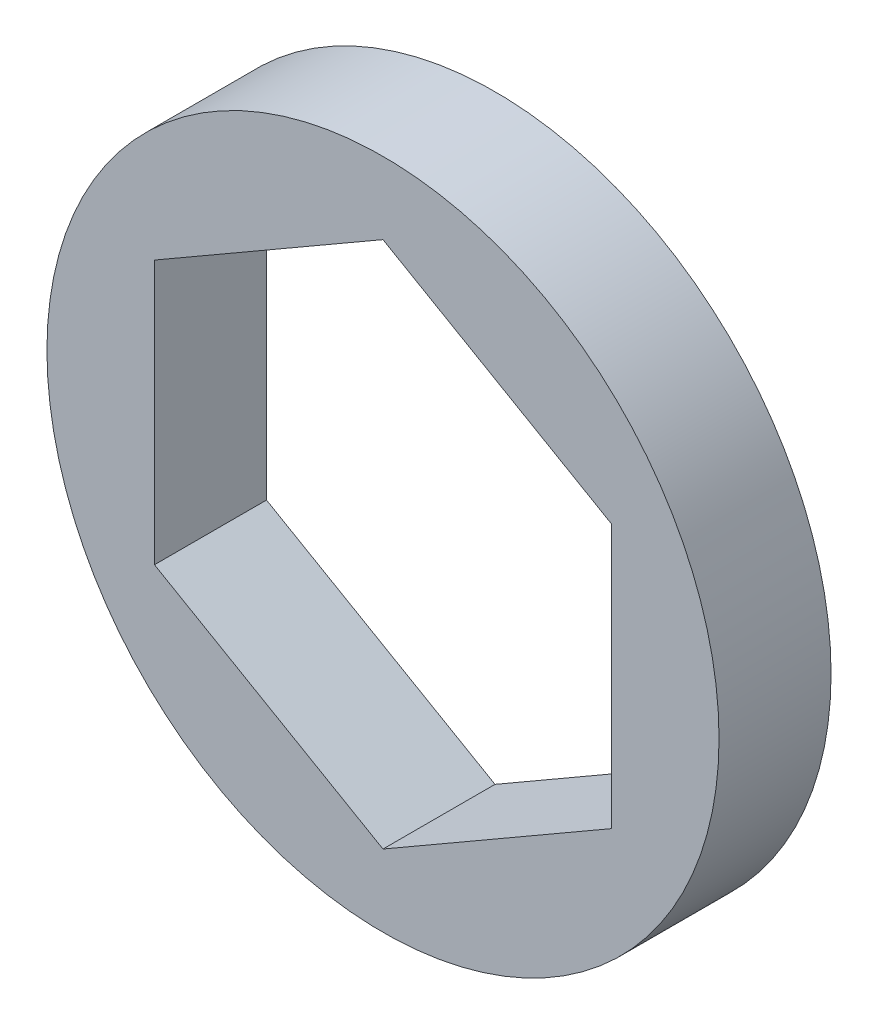
ISO-10303-21;
HEADER;
FILE_DESCRIPTION(('STEP AP214'),'2;1');
FILE_NAME('part.step','',(''),(''),'','','');
FILE_SCHEMA(('AUTOMOTIVE_DESIGN { 1 0 10303 214 1 1 1 1 }'));
ENDSEC;
DATA;
#1=APPLICATION_CONTEXT('core data for automotive mechanical design processes');
#2=APPLICATION_PROTOCOL_DEFINITION('international standard','automotive_design',2000,#1);
#3=PRODUCT_CONTEXT('',#1,'mechanical');
#4=PRODUCT('Part','Part','',(#3));
#5=PRODUCT_RELATED_PRODUCT_CATEGORY('part','',(#4));
#6=PRODUCT_DEFINITION_FORMATION('','',#4);
#7=PRODUCT_DEFINITION_CONTEXT('part definition',#1,'design');
#8=PRODUCT_DEFINITION('design','',#6,#7);
#9=PRODUCT_DEFINITION_SHAPE('','',#8);
#10=(LENGTH_UNIT() NAMED_UNIT(*) SI_UNIT(.MILLI.,.METRE.));
#11=(NAMED_UNIT(*) PLANE_ANGLE_UNIT() SI_UNIT($,.RADIAN.));
#12=(NAMED_UNIT(*) SI_UNIT($,.STERADIAN.) SOLID_ANGLE_UNIT());
#13=UNCERTAINTY_MEASURE_WITH_UNIT(LENGTH_MEASURE(1.E-05),#10,'distance_accuracy_value','');
#14=(GEOMETRIC_REPRESENTATION_CONTEXT(3) GLOBAL_UNCERTAINTY_ASSIGNED_CONTEXT((#13)) GLOBAL_UNIT_ASSIGNED_CONTEXT((#10,
#11,#12)) REPRESENTATION_CONTEXT('',''));
#15=CARTESIAN_POINT('',(0.,0.,0.));
#16=DIRECTION('',(0.,0.,1.));
#17=DIRECTION('',(1.,0.,0.));
#18=AXIS2_PLACEMENT_3D('',#15,#16,#17);
#19=CARTESIAN_POINT('',(0.,0.,-1.5875));
#20=DIRECTION('',(0.,0.,1.));
#21=DIRECTION('',(1.,0.,0.));
#22=AXIS2_PLACEMENT_3D('',#19,#20,#21);
#23=PLANE('',#22);
#24=DIRECTION('',(0.,1.,0.));
#25=VECTOR('',#24,1.);
#26=CARTESIAN_POINT('',(-6.477,3.73949769354121,-1.5875));
#27=LINE('',#26,#25);
#28=CARTESIAN_POINT('',(-6.47700000000001,-3.73949769354121,-1.5875));
#29=VERTEX_POINT('',#28);
#30=CARTESIAN_POINT('',(-6.47700000000001,3.73949769354121,-1.5875));
#31=VERTEX_POINT('',#30);
#32=EDGE_CURVE('E73',#29,#31,#27,.T.);
#33=ORIENTED_EDGE('',*,*,#32,.F.);
#34=DIRECTION('',(-0.866025403784439,0.5,0.));
#35=VECTOR('',#34,1.);
#36=CARTESIAN_POINT('',(-6.47700000000001,-3.73949769354121,-1.5875));
#37=LINE('',#36,#35);
#38=CARTESIAN_POINT('',(0.,-7.47899538708242,-1.5875));
#39=VERTEX_POINT('',#38);
#40=EDGE_CURVE('E103',#39,#29,#37,.T.);
#41=ORIENTED_EDGE('',*,*,#40,.F.);
#42=DIRECTION('',(-0.866025403784439,-0.5,0.));
#43=VECTOR('',#42,1.);
#44=CARTESIAN_POINT('',(0.,-7.47899538708242,-1.5875));
#45=LINE('',#44,#43);
#46=CARTESIAN_POINT('',(6.47700000000001,-3.73949769354122,-1.5875));
#47=VERTEX_POINT('',#46);
#48=EDGE_CURVE('E111',#47,#39,#45,.T.);
#49=ORIENTED_EDGE('',*,*,#48,.F.);
#50=DIRECTION('',(0.,-1.,0.));
#51=VECTOR('',#50,1.);
#52=CARTESIAN_POINT('',(6.47700000000001,-3.73949769354122,-1.5875));
#53=LINE('',#52,#51);
#54=CARTESIAN_POINT('',(6.47700000000001,3.73949769354121,-1.5875));
#55=VERTEX_POINT('',#54);
#56=EDGE_CURVE('E116',#55,#47,#53,.T.);
#57=ORIENTED_EDGE('',*,*,#56,.F.);
#58=DIRECTION('',(0.866025403784438,-0.500000000000001,0.));
#59=VECTOR('',#58,1.);
#60=CARTESIAN_POINT('',(6.47700000000001,3.73949769354121,-1.5875));
#61=LINE('',#60,#59);
#62=CARTESIAN_POINT('',(0.,7.47899538708242,-1.5875));
#63=VERTEX_POINT('',#62);
#64=EDGE_CURVE('E68',#63,#55,#61,.T.);
#65=ORIENTED_EDGE('',*,*,#64,.F.);
#66=DIRECTION('',(0.866025403784439,0.5,0.));
#67=VECTOR('',#66,1.);
#68=CARTESIAN_POINT('',(0.,7.47899538708242,-1.5875));
#69=LINE('',#68,#67);
#70=EDGE_CURVE('E70',#31,#63,#69,.T.);
#71=ORIENTED_EDGE('',*,*,#70,.F.);
#72=EDGE_LOOP('',(#33,#41,#49,#57,#65,#71));
#73=FACE_BOUND('',#72,.T.);
#74=CARTESIAN_POINT('',(0.,0.,-1.5875));
#75=DIRECTION('',(0.,0.,-1.));
#76=DIRECTION('',(-1.,0.,0.));
#77=AXIS2_PLACEMENT_3D('',#74,#75,#76);
#78=CIRCLE('',#77,9.525);
#79=CARTESIAN_POINT('',(-9.525,0.,-1.5875));
#80=VERTEX_POINT('',#79);
#81=EDGE_CURVE('E20',#80,#80,#78,.F.);
#82=ORIENTED_EDGE('',*,*,#81,.F.);
#83=EDGE_LOOP('',(#82));
#84=FACE_BOUND('',#83,.T.);
#85=ADVANCED_FACE('F17',(#73,#84),#23,.F.);
#86=CARTESIAN_POINT('',(0.,0.,1.5875));
#87=DIRECTION('',(0.,0.,-1.));
#88=DIRECTION('',(-1.,0.,0.));
#89=AXIS2_PLACEMENT_3D('',#86,#87,#88);
#90=CYLINDRICAL_SURFACE('',#89,9.525);
#91=ORIENTED_EDGE('',*,*,#81,.T.);
#92=EDGE_LOOP('',(#91));
#93=FACE_BOUND('',#92,.T.);
#94=CARTESIAN_POINT('',(0.,0.,1.5875));
#95=DIRECTION('',(0.,0.,-1.));
#96=DIRECTION('',(-1.,0.,0.));
#97=AXIS2_PLACEMENT_3D('',#94,#95,#96);
#98=CIRCLE('',#97,9.525);
#99=CARTESIAN_POINT('',(-9.525,0.,1.5875));
#100=VERTEX_POINT('',#99);
#101=EDGE_CURVE('E95',#100,#100,#98,.F.);
#102=ORIENTED_EDGE('',*,*,#101,.F.);
#103=EDGE_LOOP('',(#102));
#104=FACE_BOUND('',#103,.T.);
#105=ADVANCED_FACE('F153',(#93,#104),#90,.T.);
#106=CARTESIAN_POINT('',(-6.477,3.73949769354121,1.5875));
#107=DIRECTION('',(1.,0.,0.));
#108=DIRECTION('',(0.,1.,0.));
#109=AXIS2_PLACEMENT_3D('',#106,#107,#108);
#110=PLANE('',#109);
#111=DIRECTION('',(0.,1.,0.));
#112=VECTOR('',#111,1.);
#113=CARTESIAN_POINT('',(-6.47700000000001,0.,1.5875));
#114=LINE('',#113,#112);
#115=CARTESIAN_POINT('',(-6.47700000000001,-3.73949769354121,1.5875));
#116=VERTEX_POINT('',#115);
#117=CARTESIAN_POINT('',(-6.47700000000001,3.73949769354121,1.5875));
#118=VERTEX_POINT('',#117);
#119=EDGE_CURVE('E97',#116,#118,#114,.T.);
#120=ORIENTED_EDGE('',*,*,#119,.F.);
#121=DIRECTION('',(0.,0.,1.));
#122=VECTOR('',#121,1.);
#123=CARTESIAN_POINT('',(-6.47700000000001,-3.73949769354121,1.5875));
#124=LINE('',#123,#122);
#125=EDGE_CURVE('E84',#29,#116,#124,.T.);
#126=ORIENTED_EDGE('',*,*,#125,.F.);
#127=ORIENTED_EDGE('',*,*,#32,.T.);
#128=DIRECTION('',(0.,0.,1.));
#129=VECTOR('',#128,1.);
#130=CARTESIAN_POINT('',(-6.477,3.73949769354121,1.5875));
#131=LINE('',#130,#129);
#132=EDGE_CURVE('E78',#118,#31,#131,.F.);
#133=ORIENTED_EDGE('',*,*,#132,.F.);
#134=EDGE_LOOP('',(#120,#126,#127,#133));
#135=FACE_BOUND('',#134,.T.);
#136=ADVANCED_FACE('F81',(#135),#110,.T.);
#137=CARTESIAN_POINT('',(0.,7.47899538708242,1.5875));
#138=DIRECTION('',(0.5,-0.866025403784439,0.));
#139=DIRECTION('',(0.866025403784439,0.5,0.));
#140=AXIS2_PLACEMENT_3D('',#137,#138,#139);
#141=PLANE('',#140);
#142=DIRECTION('',(0.866025403784439,0.5,0.));
#143=VECTOR('',#142,1.);
#144=CARTESIAN_POINT('',(-6.477,3.73949769354121,1.5875));
#145=LINE('',#144,#143);
#146=CARTESIAN_POINT('',(0.,7.47899538708242,1.5875));
#147=VERTEX_POINT('',#146);
#148=EDGE_CURVE('E89',#118,#147,#145,.T.);
#149=ORIENTED_EDGE('',*,*,#148,.F.);
#150=ORIENTED_EDGE('',*,*,#132,.T.);
#151=ORIENTED_EDGE('',*,*,#70,.T.);
#152=DIRECTION('',(0.,0.,1.));
#153=VECTOR('',#152,1.);
#154=CARTESIAN_POINT('',(0.,7.47899538708242,1.5875));
#155=LINE('',#154,#153);
#156=EDGE_CURVE('E92',#147,#63,#155,.F.);
#157=ORIENTED_EDGE('',*,*,#156,.F.);
#158=EDGE_LOOP('',(#149,#150,#151,#157));
#159=FACE_BOUND('',#158,.T.);
#160=ADVANCED_FACE('F87',(#159),#141,.T.);
#161=CARTESIAN_POINT('',(6.47700000000001,3.73949769354121,1.5875));
#162=DIRECTION('',(-0.500000000000001,-0.866025403784438,0.));
#163=DIRECTION('',(0.866025403784438,-0.500000000000001,0.));
#164=AXIS2_PLACEMENT_3D('',#161,#162,#163);
#165=PLANE('',#164);
#166=DIRECTION('',(0.866025403784438,-0.5,0.));
#167=VECTOR('',#166,1.);
#168=CARTESIAN_POINT('',(0.,7.47899538708242,1.5875));
#169=LINE('',#168,#167);
#170=CARTESIAN_POINT('',(6.47700000000001,3.73949769354121,1.5875));
#171=VERTEX_POINT('',#170);
#172=EDGE_CURVE('E122',#147,#171,#169,.T.);
#173=ORIENTED_EDGE('',*,*,#172,.F.);
#174=ORIENTED_EDGE('',*,*,#156,.T.);
#175=ORIENTED_EDGE('',*,*,#64,.T.);
#176=DIRECTION('',(0.,0.,1.));
#177=VECTOR('',#176,1.);
#178=CARTESIAN_POINT('',(6.47700000000001,3.73949769354121,1.5875));
#179=LINE('',#178,#177);
#180=EDGE_CURVE('E113',#171,#55,#179,.F.);
#181=ORIENTED_EDGE('',*,*,#180,.F.);
#182=EDGE_LOOP('',(#173,#174,#175,#181));
#183=FACE_BOUND('',#182,.T.);
#184=ADVANCED_FACE('F120',(#183),#165,.T.);
#185=CARTESIAN_POINT('',(6.47700000000001,-3.73949769354122,1.5875));
#186=DIRECTION('',(-1.,0.,0.));
#187=DIRECTION('',(0.,-1.,0.));
#188=AXIS2_PLACEMENT_3D('',#185,#186,#187);
#189=PLANE('',#188);
#190=DIRECTION('',(0.,1.,0.));
#191=VECTOR('',#190,1.);
#192=CARTESIAN_POINT('',(6.47700000000001,0.,1.5875));
#193=LINE('',#192,#191);
#194=CARTESIAN_POINT('',(6.47700000000001,-3.73949769354122,1.5875));
#195=VERTEX_POINT('',#194);
#196=EDGE_CURVE('E126',#171,#195,#193,.F.);
#197=ORIENTED_EDGE('',*,*,#196,.F.);
#198=ORIENTED_EDGE('',*,*,#180,.T.);
#199=ORIENTED_EDGE('',*,*,#56,.T.);
#200=DIRECTION('',(0.,0.,1.));
#201=VECTOR('',#200,1.);
#202=CARTESIAN_POINT('',(6.477,-3.73949769354122,1.5875));
#203=LINE('',#202,#201);
#204=EDGE_CURVE('E108',#195,#47,#203,.F.);
#205=ORIENTED_EDGE('',*,*,#204,.F.);
#206=EDGE_LOOP('',(#197,#198,#199,#205));
#207=FACE_BOUND('',#206,.T.);
#208=ADVANCED_FACE('F134',(#207),#189,.T.);
#209=CARTESIAN_POINT('',(0.,-7.47899538708242,1.5875));
#210=DIRECTION('',(-0.5,0.866025403784439,0.));
#211=DIRECTION('',(-0.866025403784439,-0.5,0.));
#212=AXIS2_PLACEMENT_3D('',#209,#210,#211);
#213=PLANE('',#212);
#214=DIRECTION('',(-0.866025403784439,-0.5,0.));
#215=VECTOR('',#214,1.);
#216=CARTESIAN_POINT('',(6.47700000000001,-3.73949769354122,1.5875));
#217=LINE('',#216,#215);
#218=CARTESIAN_POINT('',(0.,-7.47899538708242,1.5875));
#219=VERTEX_POINT('',#218);
#220=EDGE_CURVE('E26',#195,#219,#217,.T.);
#221=ORIENTED_EDGE('',*,*,#220,.F.);
#222=ORIENTED_EDGE('',*,*,#204,.T.);
#223=ORIENTED_EDGE('',*,*,#48,.T.);
#224=DIRECTION('',(0.,0.,1.));
#225=VECTOR('',#224,1.);
#226=CARTESIAN_POINT('',(0.,-7.47899538708242,1.5875));
#227=LINE('',#226,#225);
#228=EDGE_CURVE('E35',#219,#39,#227,.F.);
#229=ORIENTED_EDGE('',*,*,#228,.F.);
#230=EDGE_LOOP('',(#221,#222,#223,#229));
#231=FACE_BOUND('',#230,.T.);
#232=ADVANCED_FACE('F132',(#231),#213,.T.);
#233=CARTESIAN_POINT('',(-6.47700000000001,-3.73949769354121,1.5875));
#234=DIRECTION('',(0.5,0.866025403784439,0.));
#235=DIRECTION('',(-0.866025403784439,0.5,0.));
#236=AXIS2_PLACEMENT_3D('',#233,#234,#235);
#237=PLANE('',#236);
#238=DIRECTION('',(-0.866025403784438,0.5,0.));
#239=VECTOR('',#238,1.);
#240=CARTESIAN_POINT('',(0.,-7.47899538708242,1.5875));
#241=LINE('',#240,#239);
#242=EDGE_CURVE('E11',#219,#116,#241,.T.);
#243=ORIENTED_EDGE('',*,*,#242,.F.);
#244=ORIENTED_EDGE('',*,*,#228,.T.);
#245=ORIENTED_EDGE('',*,*,#40,.T.);
#246=ORIENTED_EDGE('',*,*,#125,.T.);
#247=EDGE_LOOP('',(#243,#244,#245,#246));
#248=FACE_BOUND('',#247,.T.);
#249=ADVANCED_FACE('F135',(#248),#237,.T.);
#250=CARTESIAN_POINT('',(0.,0.,1.5875));
#251=DIRECTION('',(0.,0.,1.));
#252=DIRECTION('',(1.,0.,0.));
#253=AXIS2_PLACEMENT_3D('',#250,#251,#252);
#254=PLANE('',#253);
#255=ORIENTED_EDGE('',*,*,#220,.T.);
#256=ORIENTED_EDGE('',*,*,#242,.T.);
#257=ORIENTED_EDGE('',*,*,#119,.T.);
#258=ORIENTED_EDGE('',*,*,#148,.T.);
#259=ORIENTED_EDGE('',*,*,#172,.T.);
#260=ORIENTED_EDGE('',*,*,#196,.T.);
#261=EDGE_LOOP('',(#255,#256,#257,#258,#259,#260));
#262=FACE_BOUND('',#261,.T.);
#263=ORIENTED_EDGE('',*,*,#101,.T.);
#264=EDGE_LOOP('',(#263));
#265=FACE_BOUND('',#264,.T.);
#266=ADVANCED_FACE('F129',(#262,#265),#254,.T.);
#267=CLOSED_SHELL('',(#85,#105,#136,#160,#184,#208,#232,#249,#266));
#268=MANIFOLD_SOLID_BREP('B1',#267);
#269=ADVANCED_BREP_SHAPE_REPRESENTATION('',(#18,#268),#14);
#270=SHAPE_DEFINITION_REPRESENTATION(#9,#269);
ENDSEC;
END-ISO-10303-21;
